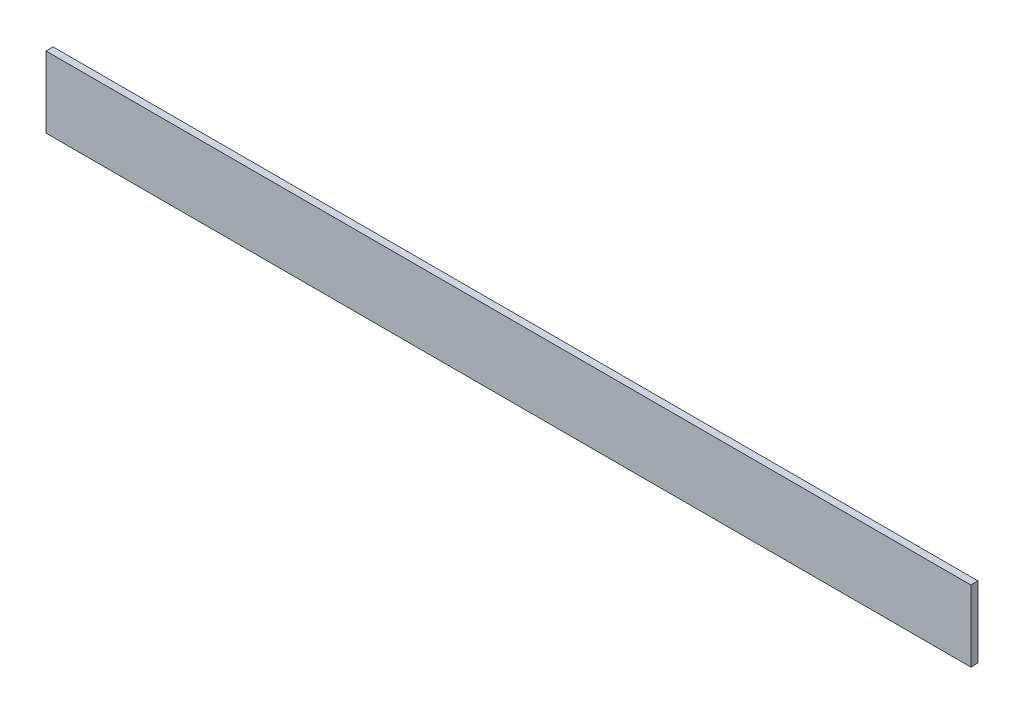
ISO-10303-21;
HEADER;
FILE_DESCRIPTION(('STEP AP214'),'2;1');
FILE_NAME('part.step','',(''),(''),'','','');
FILE_SCHEMA(('AUTOMOTIVE_DESIGN { 1 0 10303 214 1 1 1 1 }'));
ENDSEC;
DATA;
#1=APPLICATION_CONTEXT('core data for automotive mechanical design processes');
#2=APPLICATION_PROTOCOL_DEFINITION('international standard','automotive_design',2000,#1);
#3=PRODUCT_CONTEXT('',#1,'mechanical');
#4=PRODUCT('Part','Part','',(#3));
#5=PRODUCT_RELATED_PRODUCT_CATEGORY('part','',(#4));
#6=PRODUCT_DEFINITION_FORMATION('','',#4);
#7=PRODUCT_DEFINITION_CONTEXT('part definition',#1,'design');
#8=PRODUCT_DEFINITION('design','',#6,#7);
#9=PRODUCT_DEFINITION_SHAPE('','',#8);
#10=(LENGTH_UNIT() NAMED_UNIT(*) SI_UNIT(.MILLI.,.METRE.));
#11=(NAMED_UNIT(*) PLANE_ANGLE_UNIT() SI_UNIT($,.RADIAN.));
#12=(NAMED_UNIT(*) SI_UNIT($,.STERADIAN.) SOLID_ANGLE_UNIT());
#13=UNCERTAINTY_MEASURE_WITH_UNIT(LENGTH_MEASURE(1.E-05),#10,'distance_accuracy_value','');
#14=(GEOMETRIC_REPRESENTATION_CONTEXT(3) GLOBAL_UNCERTAINTY_ASSIGNED_CONTEXT((#13)) GLOBAL_UNIT_ASSIGNED_CONTEXT((#10,
#11,#12)) REPRESENTATION_CONTEXT('',''));
#15=CARTESIAN_POINT('',(0.,0.,0.));
#16=DIRECTION('',(0.,0.,1.));
#17=DIRECTION('',(1.,0.,0.));
#18=AXIS2_PLACEMENT_3D('',#15,#16,#17);
#19=CARTESIAN_POINT('',(0.,0.,-10.));
#20=DIRECTION('',(-1.,0.,0.));
#21=DIRECTION('',(0.,-1.,0.));
#22=AXIS2_PLACEMENT_3D('',#19,#20,#21);
#23=PLANE('',#22);
#24=DIRECTION('',(0.,-1.,0.));
#25=VECTOR('',#24,1.);
#26=CARTESIAN_POINT('',(0.,0.,0.));
#27=LINE('',#26,#25);
#28=CARTESIAN_POINT('',(0.,0.,0.));
#29=VERTEX_POINT('',#28);
#30=CARTESIAN_POINT('',(0.,-100.,0.));
#31=VERTEX_POINT('',#30);
#32=EDGE_CURVE('E106',#29,#31,#27,.T.);
#33=ORIENTED_EDGE('',*,*,#32,.F.);
#34=DIRECTION('',(0.,0.,1.));
#35=VECTOR('',#34,1.);
#36=CARTESIAN_POINT('',(0.,0.,-10.));
#37=LINE('',#36,#35);
#38=CARTESIAN_POINT('',(0.,0.,-10.));
#39=VERTEX_POINT('',#38);
#40=EDGE_CURVE('E11',#39,#29,#37,.T.);
#41=ORIENTED_EDGE('',*,*,#40,.F.);
#42=DIRECTION('',(0.,-1.,0.));
#43=VECTOR('',#42,1.);
#44=CARTESIAN_POINT('',(0.,0.,-10.));
#45=LINE('',#44,#43);
#46=CARTESIAN_POINT('',(0.,-100.,-10.));
#47=VERTEX_POINT('',#46);
#48=EDGE_CURVE('E100',#39,#47,#45,.T.);
#49=ORIENTED_EDGE('',*,*,#48,.T.);
#50=DIRECTION('',(0.,0.,1.));
#51=VECTOR('',#50,1.);
#52=CARTESIAN_POINT('',(0.,-100.,-10.));
#53=LINE('',#52,#51);
#54=EDGE_CURVE('E45',#47,#31,#53,.T.);
#55=ORIENTED_EDGE('',*,*,#54,.T.);
#56=EDGE_LOOP('',(#33,#41,#49,#55));
#57=FACE_BOUND('',#56,.T.);
#58=ADVANCED_FACE('F42',(#57),#23,.T.);
#59=CARTESIAN_POINT('',(0.,0.,-10.));
#60=DIRECTION('',(0.,1.,0.));
#61=DIRECTION('',(0.,0.,1.));
#62=AXIS2_PLACEMENT_3D('',#59,#60,#61);
#63=PLANE('',#62);
#64=DIRECTION('',(-1.,0.,0.));
#65=VECTOR('',#64,1.);
#66=CARTESIAN_POINT('',(0.,0.,0.));
#67=LINE('',#66,#65);
#68=CARTESIAN_POINT('',(1300.,0.,0.));
#69=VERTEX_POINT('',#68);
#70=EDGE_CURVE('E102',#69,#29,#67,.T.);
#71=ORIENTED_EDGE('',*,*,#70,.F.);
#72=DIRECTION('',(0.,0.,1.));
#73=VECTOR('',#72,1.);
#74=CARTESIAN_POINT('',(1300.,0.,-10.));
#75=LINE('',#74,#73);
#76=CARTESIAN_POINT('',(1300.,0.,-10.));
#77=VERTEX_POINT('',#76);
#78=EDGE_CURVE('E51',#77,#69,#75,.T.);
#79=ORIENTED_EDGE('',*,*,#78,.F.);
#80=DIRECTION('',(-1.,0.,0.));
#81=VECTOR('',#80,1.);
#82=CARTESIAN_POINT('',(0.,0.,-10.));
#83=LINE('',#82,#81);
#84=EDGE_CURVE('E97',#77,#39,#83,.T.);
#85=ORIENTED_EDGE('',*,*,#84,.T.);
#86=ORIENTED_EDGE('',*,*,#40,.T.);
#87=EDGE_LOOP('',(#71,#79,#85,#86));
#88=FACE_BOUND('',#87,.T.);
#89=ADVANCED_FACE('F116',(#88),#63,.T.);
#90=CARTESIAN_POINT('',(1300.,0.,-10.));
#91=DIRECTION('',(1.,0.,0.));
#92=DIRECTION('',(0.,0.,-1.));
#93=AXIS2_PLACEMENT_3D('',#90,#91,#92);
#94=PLANE('',#93);
#95=DIRECTION('',(0.,1.,0.));
#96=VECTOR('',#95,1.);
#97=CARTESIAN_POINT('',(1300.,0.,0.));
#98=LINE('',#97,#96);
#99=CARTESIAN_POINT('',(1300.,-100.,0.));
#100=VERTEX_POINT('',#99);
#101=EDGE_CURVE('E92',#100,#69,#98,.T.);
#102=ORIENTED_EDGE('',*,*,#101,.F.);
#103=DIRECTION('',(0.,0.,1.));
#104=VECTOR('',#103,1.);
#105=CARTESIAN_POINT('',(1300.,-100.,-10.));
#106=LINE('',#105,#104);
#107=CARTESIAN_POINT('',(1300.,-100.,-10.));
#108=VERTEX_POINT('',#107);
#109=EDGE_CURVE('E87',#108,#100,#106,.T.);
#110=ORIENTED_EDGE('',*,*,#109,.F.);
#111=DIRECTION('',(0.,1.,0.));
#112=VECTOR('',#111,1.);
#113=CARTESIAN_POINT('',(1300.,0.,-10.));
#114=LINE('',#113,#112);
#115=EDGE_CURVE('E90',#108,#77,#114,.T.);
#116=ORIENTED_EDGE('',*,*,#115,.T.);
#117=ORIENTED_EDGE('',*,*,#78,.T.);
#118=EDGE_LOOP('',(#102,#110,#116,#117));
#119=FACE_BOUND('',#118,.T.);
#120=ADVANCED_FACE('F89',(#119),#94,.T.);
#121=CARTESIAN_POINT('',(0.,-100.,-10.));
#122=DIRECTION('',(0.,-1.,0.));
#123=DIRECTION('',(0.,0.,-1.));
#124=AXIS2_PLACEMENT_3D('',#121,#122,#123);
#125=PLANE('',#124);
#126=DIRECTION('',(1.,0.,0.));
#127=VECTOR('',#126,1.);
#128=CARTESIAN_POINT('',(0.,-100.,0.));
#129=LINE('',#128,#127);
#130=EDGE_CURVE('E109',#31,#100,#129,.T.);
#131=ORIENTED_EDGE('',*,*,#130,.F.);
#132=ORIENTED_EDGE('',*,*,#54,.F.);
#133=DIRECTION('',(1.,0.,0.));
#134=VECTOR('',#133,1.);
#135=CARTESIAN_POINT('',(0.,-100.,-10.));
#136=LINE('',#135,#134);
#137=EDGE_CURVE('E96',#47,#108,#136,.T.);
#138=ORIENTED_EDGE('',*,*,#137,.T.);
#139=ORIENTED_EDGE('',*,*,#109,.T.);
#140=EDGE_LOOP('',(#131,#132,#138,#139));
#141=FACE_BOUND('',#140,.T.);
#142=ADVANCED_FACE('F99',(#141),#125,.T.);
#143=CARTESIAN_POINT('',(0.,0.,-10.));
#144=DIRECTION('',(0.,0.,1.));
#145=DIRECTION('',(1.,0.,0.));
#146=AXIS2_PLACEMENT_3D('',#143,#144,#145);
#147=PLANE('',#146);
#148=ORIENTED_EDGE('',*,*,#48,.F.);
#149=ORIENTED_EDGE('',*,*,#84,.F.);
#150=ORIENTED_EDGE('',*,*,#115,.F.);
#151=ORIENTED_EDGE('',*,*,#137,.F.);
#152=EDGE_LOOP('',(#148,#149,#150,#151));
#153=FACE_BOUND('',#152,.T.);
#154=ADVANCED_FACE('F95',(#153),#147,.F.);
#155=CARTESIAN_POINT('',(0.,0.,0.));
#156=DIRECTION('',(0.,0.,1.));
#157=DIRECTION('',(1.,0.,0.));
#158=AXIS2_PLACEMENT_3D('',#155,#156,#157);
#159=PLANE('',#158);
#160=ORIENTED_EDGE('',*,*,#32,.T.);
#161=ORIENTED_EDGE('',*,*,#130,.T.);
#162=ORIENTED_EDGE('',*,*,#101,.T.);
#163=ORIENTED_EDGE('',*,*,#70,.T.);
#164=EDGE_LOOP('',(#160,#161,#162,#163));
#165=FACE_BOUND('',#164,.T.);
#166=ADVANCED_FACE('F115',(#165),#159,.T.);
#167=CLOSED_SHELL('',(#58,#89,#120,#142,#154,#166));
#168=MANIFOLD_SOLID_BREP('B2',#167);
#169=ADVANCED_BREP_SHAPE_REPRESENTATION('',(#18,#168),#14);
#170=SHAPE_DEFINITION_REPRESENTATION(#9,#169);
ENDSEC;
END-ISO-10303-21;
